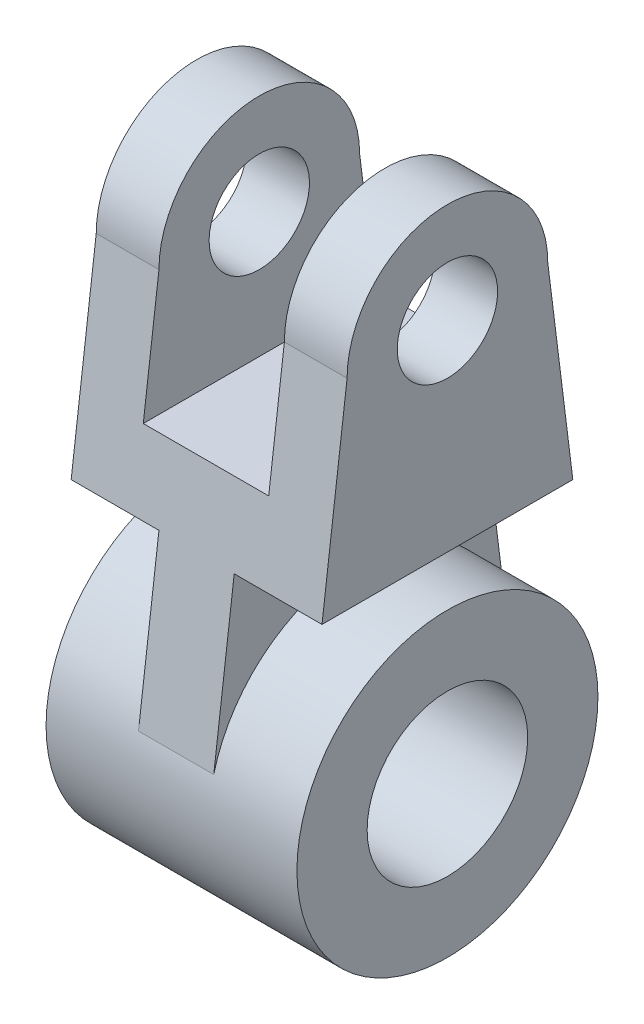
ISO-10303-21;
HEADER;
FILE_DESCRIPTION(('STEP AP214'),'2;1');
FILE_NAME('part.step','',(''),(''),'','','');
FILE_SCHEMA(('AUTOMOTIVE_DESIGN { 1 0 10303 214 1 1 1 1 }'));
ENDSEC;
DATA;
#1=APPLICATION_CONTEXT('core data for automotive mechanical design processes');
#2=APPLICATION_PROTOCOL_DEFINITION('international standard','automotive_design',2000,#1);
#3=PRODUCT_CONTEXT('',#1,'mechanical');
#4=PRODUCT('Part','Part','',(#3));
#5=PRODUCT_RELATED_PRODUCT_CATEGORY('part','',(#4));
#6=PRODUCT_DEFINITION_FORMATION('','',#4);
#7=PRODUCT_DEFINITION_CONTEXT('part definition',#1,'design');
#8=PRODUCT_DEFINITION('design','',#6,#7);
#9=PRODUCT_DEFINITION_SHAPE('','',#8);
#10=(LENGTH_UNIT() NAMED_UNIT(*) SI_UNIT(.MILLI.,.METRE.));
#11=(NAMED_UNIT(*) PLANE_ANGLE_UNIT() SI_UNIT($,.RADIAN.));
#12=(NAMED_UNIT(*) SI_UNIT($,.STERADIAN.) SOLID_ANGLE_UNIT());
#13=UNCERTAINTY_MEASURE_WITH_UNIT(LENGTH_MEASURE(1.E-05),#10,'distance_accuracy_value','');
#14=(GEOMETRIC_REPRESENTATION_CONTEXT(3) GLOBAL_UNCERTAINTY_ASSIGNED_CONTEXT((#13)) GLOBAL_UNIT_ASSIGNED_CONTEXT((#10,
#11,#12)) REPRESENTATION_CONTEXT('',''));
#15=CARTESIAN_POINT('',(0.,0.,0.));
#16=DIRECTION('',(0.,0.,1.));
#17=DIRECTION('',(1.,0.,0.));
#18=AXIS2_PLACEMENT_3D('',#15,#16,#17);
#19=CARTESIAN_POINT('',(25.,80.,0.));
#20=DIRECTION('',(-1.,0.,0.));
#21=DIRECTION('',(0.,0.,1.));
#22=AXIS2_PLACEMENT_3D('',#19,#20,#21);
#23=CYLINDRICAL_SURFACE('',#22,20.);
#24=DIRECTION('',(-1.,0.,0.));
#25=VECTOR('',#24,1.);
#26=CARTESIAN_POINT('',(25.,80.,-20.));
#27=LINE('',#26,#25);
#28=CARTESIAN_POINT('',(25.,80.,-20.));
#29=VERTEX_POINT('',#28);
#30=CARTESIAN_POINT('',(12.5,80.,-20.));
#31=VERTEX_POINT('',#30);
#32=EDGE_CURVE('E217',#29,#31,#27,.T.);
#33=ORIENTED_EDGE('',*,*,#32,.T.);
#34=CARTESIAN_POINT('',(12.5,80.,0.));
#35=DIRECTION('',(1.,0.,0.));
#36=DIRECTION('',(0.,1.,0.));
#37=AXIS2_PLACEMENT_3D('',#34,#35,#36);
#38=CIRCLE('',#37,20.);
#39=CARTESIAN_POINT('',(12.5,80.,20.));
#40=VERTEX_POINT('',#39);
#41=EDGE_CURVE('E169',#31,#40,#38,.T.);
#42=ORIENTED_EDGE('',*,*,#41,.T.);
#43=DIRECTION('',(-1.,0.,0.));
#44=VECTOR('',#43,1.);
#45=CARTESIAN_POINT('',(25.,80.,20.));
#46=LINE('',#45,#44);
#47=CARTESIAN_POINT('',(25.,80.,20.));
#48=VERTEX_POINT('',#47);
#49=EDGE_CURVE('E234',#48,#40,#46,.T.);
#50=ORIENTED_EDGE('',*,*,#49,.F.);
#51=CARTESIAN_POINT('',(25.,80.,0.));
#52=DIRECTION('',(1.,0.,0.));
#53=DIRECTION('',(0.,0.,-1.));
#54=AXIS2_PLACEMENT_3D('',#51,#52,#53);
#55=CIRCLE('',#54,20.);
#56=EDGE_CURVE('E190',#29,#48,#55,.T.);
#57=ORIENTED_EDGE('',*,*,#56,.F.);
#58=EDGE_LOOP('',(#33,#42,#50,#57));
#59=FACE_BOUND('',#58,.T.);
#60=ADVANCED_FACE('F49',(#59),#23,.T.);
#61=CARTESIAN_POINT('',(25.,80.,0.));
#62=DIRECTION('',(-1.,0.,0.));
#63=DIRECTION('',(0.,0.,1.));
#64=AXIS2_PLACEMENT_3D('',#61,#62,#63);
#65=CYLINDRICAL_SURFACE('',#64,10.);
#66=CARTESIAN_POINT('',(12.5,80.,0.));
#67=DIRECTION('',(1.,0.,0.));
#68=DIRECTION('',(0.,1.,0.));
#69=AXIS2_PLACEMENT_3D('',#66,#67,#68);
#70=CIRCLE('',#69,10.);
#71=CARTESIAN_POINT('',(12.5,90.,0.));
#72=VERTEX_POINT('',#71);
#73=EDGE_CURVE('E164',#72,#72,#70,.T.);
#74=ORIENTED_EDGE('',*,*,#73,.F.);
#75=EDGE_LOOP('',(#74));
#76=FACE_BOUND('',#75,.T.);
#77=CARTESIAN_POINT('',(25.,80.,0.));
#78=DIRECTION('',(1.,0.,0.));
#79=DIRECTION('',(0.,0.,-1.));
#80=AXIS2_PLACEMENT_3D('',#77,#78,#79);
#81=CIRCLE('',#80,10.);
#82=CARTESIAN_POINT('',(25.,80.,-10.));
#83=VERTEX_POINT('',#82);
#84=EDGE_CURVE('E182',#83,#83,#81,.T.);
#85=ORIENTED_EDGE('',*,*,#84,.T.);
#86=EDGE_LOOP('',(#85));
#87=FACE_BOUND('',#86,.T.);
#88=ADVANCED_FACE('F355',(#76,#87),#65,.F.);
#89=CARTESIAN_POINT('',(25.,0.,0.));
#90=DIRECTION('',(1.,0.,0.));
#91=DIRECTION('',(0.,0.,-1.));
#92=AXIS2_PLACEMENT_3D('',#89,#90,#91);
#93=PLANE('',#92);
#94=CARTESIAN_POINT('',(25.,0.,0.));
#95=DIRECTION('',(1.,0.,0.));
#96=DIRECTION('',(0.,0.,-1.));
#97=AXIS2_PLACEMENT_3D('',#94,#95,#96);
#98=CIRCLE('',#97,30.);
#99=CARTESIAN_POINT('',(25.,0.,-30.));
#100=VERTEX_POINT('',#99);
#101=EDGE_CURVE('E296',#100,#100,#98,.T.);
#102=ORIENTED_EDGE('',*,*,#101,.T.);
#103=EDGE_LOOP('',(#102));
#104=FACE_BOUND('',#103,.T.);
#105=CARTESIAN_POINT('',(25.,0.,0.));
#106=DIRECTION('',(1.,0.,0.));
#107=DIRECTION('',(0.,0.,-1.));
#108=AXIS2_PLACEMENT_3D('',#105,#106,#107);
#109=CIRCLE('',#108,16.);
#110=CARTESIAN_POINT('',(25.,0.,-16.));
#111=VERTEX_POINT('',#110);
#112=EDGE_CURVE('E288',#111,#111,#109,.T.);
#113=ORIENTED_EDGE('',*,*,#112,.F.);
#114=EDGE_LOOP('',(#113));
#115=FACE_BOUND('',#114,.T.);
#116=ADVANCED_FACE('F360',(#104,#115),#93,.T.);
#117=CARTESIAN_POINT('',(-25.,0.,0.));
#118=DIRECTION('',(1.,0.,0.));
#119=DIRECTION('',(0.,0.,-1.));
#120=AXIS2_PLACEMENT_3D('',#117,#118,#119);
#121=PLANE('',#120);
#122=CARTESIAN_POINT('',(-25.,0.,0.));
#123=DIRECTION('',(1.,0.,0.));
#124=DIRECTION('',(0.,0.,-1.));
#125=AXIS2_PLACEMENT_3D('',#122,#123,#124);
#126=CIRCLE('',#125,30.);
#127=CARTESIAN_POINT('',(-25.,0.,-30.));
#128=VERTEX_POINT('',#127);
#129=EDGE_CURVE('E292',#128,#128,#126,.T.);
#130=ORIENTED_EDGE('',*,*,#129,.F.);
#131=EDGE_LOOP('',(#130));
#132=FACE_BOUND('',#131,.T.);
#133=CARTESIAN_POINT('',(-25.,0.,0.));
#134=DIRECTION('',(1.,0.,0.));
#135=DIRECTION('',(0.,0.,-1.));
#136=AXIS2_PLACEMENT_3D('',#133,#134,#135);
#137=CIRCLE('',#136,16.);
#138=CARTESIAN_POINT('',(-25.,0.,-16.));
#139=VERTEX_POINT('',#138);
#140=EDGE_CURVE('E287',#139,#139,#137,.T.);
#141=ORIENTED_EDGE('',*,*,#140,.T.);
#142=EDGE_LOOP('',(#141));
#143=FACE_BOUND('',#142,.T.);
#144=ADVANCED_FACE('F395',(#132,#143),#121,.F.);
#145=CARTESIAN_POINT('',(25.,0.,0.));
#146=DIRECTION('',(-1.,0.,0.));
#147=DIRECTION('',(0.,0.,1.));
#148=AXIS2_PLACEMENT_3D('',#145,#146,#147);
#149=CYLINDRICAL_SURFACE('',#148,30.);
#150=DIRECTION('',(-1.,0.,0.));
#151=VECTOR('',#150,1.);
#152=CARTESIAN_POINT('',(25.,7.38461538461518,-29.0769230769231));
#153=LINE('',#152,#151);
#154=CARTESIAN_POINT('',(-7.5,7.38461538461545,-29.0769230769231));
#155=VERTEX_POINT('',#154);
#156=CARTESIAN_POINT('',(7.5,7.38461538461517,-29.0769230769231));
#157=VERTEX_POINT('',#156);
#158=EDGE_CURVE('E58',#155,#157,#153,.F.);
#159=ORIENTED_EDGE('',*,*,#158,.T.);
#160=CARTESIAN_POINT('',(7.5,0.,0.));
#161=DIRECTION('',(1.,0.,0.));
#162=DIRECTION('',(0.,0.,-1.));
#163=AXIS2_PLACEMENT_3D('',#160,#161,#162);
#164=CIRCLE('',#163,30.);
#165=CARTESIAN_POINT('',(7.5,7.38461538461517,29.0769230769231));
#166=VERTEX_POINT('',#165);
#167=EDGE_CURVE('E283',#157,#166,#164,.T.);
#168=ORIENTED_EDGE('',*,*,#167,.T.);
#169=DIRECTION('',(-1.,0.,0.));
#170=VECTOR('',#169,1.);
#171=CARTESIAN_POINT('',(25.,7.38461538461518,29.0769230769231));
#172=LINE('',#171,#170);
#173=CARTESIAN_POINT('',(-7.5,7.38461538461545,29.0769230769231));
#174=VERTEX_POINT('',#173);
#175=EDGE_CURVE('E300',#166,#174,#172,.T.);
#176=ORIENTED_EDGE('',*,*,#175,.T.);
#177=CARTESIAN_POINT('',(-7.5,0.,0.));
#178=DIRECTION('',(-1.,0.,0.));
#179=DIRECTION('',(0.,0.,1.));
#180=AXIS2_PLACEMENT_3D('',#177,#178,#179);
#181=CIRCLE('',#180,30.);
#182=EDGE_CURVE('E259',#174,#155,#181,.T.);
#183=ORIENTED_EDGE('',*,*,#182,.T.);
#184=EDGE_LOOP('',(#159,#168,#176,#183));
#185=FACE_BOUND('',#184,.T.);
#186=ORIENTED_EDGE('',*,*,#101,.F.);
#187=EDGE_LOOP('',(#186));
#188=FACE_BOUND('',#187,.T.);
#189=ORIENTED_EDGE('',*,*,#129,.T.);
#190=EDGE_LOOP('',(#189));
#191=FACE_BOUND('',#190,.T.);
#192=ADVANCED_FACE('F51',(#185,#188,#191),#149,.T.);
#193=CARTESIAN_POINT('',(25.,0.,0.));
#194=DIRECTION('',(-1.,0.,0.));
#195=DIRECTION('',(0.,0.,1.));
#196=AXIS2_PLACEMENT_3D('',#193,#194,#195);
#197=CYLINDRICAL_SURFACE('',#196,16.);
#198=ORIENTED_EDGE('',*,*,#112,.T.);
#199=EDGE_LOOP('',(#198));
#200=FACE_BOUND('',#199,.T.);
#201=ORIENTED_EDGE('',*,*,#140,.F.);
#202=EDGE_LOOP('',(#201));
#203=FACE_BOUND('',#202,.T.);
#204=ADVANCED_FACE('F390',(#200,#203),#197,.F.);
#205=CARTESIAN_POINT('',(0.,3.69230769230769,-29.5384615384616));
#206=DIRECTION('',(0.,0.124034734589208,-0.992277876713668));
#207=DIRECTION('',(0.,0.992277876713668,0.124034734589208));
#208=AXIS2_PLACEMENT_3D('',#205,#206,#207);
#209=PLANE('',#208);
#210=DIRECTION('',(0.,-0.992277876713668,-0.124034734589208));
#211=VECTOR('',#210,1.);
#212=CARTESIAN_POINT('',(12.5,3.69230769230769,-29.5384615384616));
#213=LINE('',#212,#211);
#214=CARTESIAN_POINT('',(12.5,55.,-23.125));
#215=VERTEX_POINT('',#214);
#216=EDGE_CURVE('E151',#31,#215,#213,.T.);
#217=ORIENTED_EDGE('',*,*,#216,.F.);
#218=ORIENTED_EDGE('',*,*,#32,.F.);
#219=DIRECTION('',(0.,0.992277876713668,0.124034734589208));
#220=VECTOR('',#219,1.);
#221=CARTESIAN_POINT('',(25.,40.,-25.));
#222=LINE('',#221,#220);
#223=CARTESIAN_POINT('',(25.,40.,-25.));
#224=VERTEX_POINT('',#223);
#225=EDGE_CURVE('E201',#224,#29,#222,.T.);
#226=ORIENTED_EDGE('',*,*,#225,.F.);
#227=DIRECTION('',(-1.,0.,0.));
#228=VECTOR('',#227,1.);
#229=CARTESIAN_POINT('',(25.,40.,-25.));
#230=LINE('',#229,#228);
#231=CARTESIAN_POINT('',(7.5,40.,-25.));
#232=VERTEX_POINT('',#231);
#233=EDGE_CURVE('E230',#224,#232,#230,.T.);
#234=ORIENTED_EDGE('',*,*,#233,.T.);
#235=DIRECTION('',(0.,-0.992277876713668,-0.124034734589208));
#236=VECTOR('',#235,1.);
#237=CARTESIAN_POINT('',(7.5,40.,-25.));
#238=LINE('',#237,#236);
#239=EDGE_CURVE('E263',#232,#157,#238,.T.);
#240=ORIENTED_EDGE('',*,*,#239,.T.);
#241=ORIENTED_EDGE('',*,*,#158,.F.);
#242=DIRECTION('',(0.,-0.992277876713668,-0.124034734589208));
#243=VECTOR('',#242,1.);
#244=CARTESIAN_POINT('',(-7.5,40.,-25.));
#245=LINE('',#244,#243);
#246=CARTESIAN_POINT('',(-7.5,40.,-25.));
#247=VERTEX_POINT('',#246);
#248=EDGE_CURVE('E73',#247,#155,#245,.T.);
#249=ORIENTED_EDGE('',*,*,#248,.F.);
#250=CARTESIAN_POINT('',(-25.,40.,-25.));
#251=VERTEX_POINT('',#250);
#252=EDGE_CURVE('E221',#247,#251,#230,.T.);
#253=ORIENTED_EDGE('',*,*,#252,.T.);
#254=DIRECTION('',(0.,0.992277876713668,0.124034734589208));
#255=VECTOR('',#254,1.);
#256=CARTESIAN_POINT('',(-25.,40.,-25.));
#257=LINE('',#256,#255);
#258=CARTESIAN_POINT('',(-25.,80.,-20.));
#259=VERTEX_POINT('',#258);
#260=EDGE_CURVE('E195',#251,#259,#257,.T.);
#261=ORIENTED_EDGE('',*,*,#260,.T.);
#262=CARTESIAN_POINT('',(-12.5,80.,-20.));
#263=VERTEX_POINT('',#262);
#264=EDGE_CURVE('E162',#263,#259,#27,.T.);
#265=ORIENTED_EDGE('',*,*,#264,.F.);
#266=DIRECTION('',(0.,0.992277876713668,0.124034734589208));
#267=VECTOR('',#266,1.);
#268=CARTESIAN_POINT('',(-12.5,3.69230769230769,-29.5384615384616));
#269=LINE('',#268,#267);
#270=CARTESIAN_POINT('',(-12.5,55.,-23.125));
#271=VERTEX_POINT('',#270);
#272=EDGE_CURVE('E65',#271,#263,#269,.T.);
#273=ORIENTED_EDGE('',*,*,#272,.F.);
#274=DIRECTION('',(-1.,0.,0.));
#275=VECTOR('',#274,1.);
#276=CARTESIAN_POINT('',(0.,55.,-23.125));
#277=LINE('',#276,#275);
#278=EDGE_CURVE('E141',#215,#271,#277,.T.);
#279=ORIENTED_EDGE('',*,*,#278,.F.);
#280=EDGE_LOOP('',(#217,#218,#226,#234,#240,#241,#249,#253,#261,#265,#273,#279));
#281=FACE_BOUND('',#280,.T.);
#282=ADVANCED_FACE('F160',(#281),#209,.T.);
#283=CARTESIAN_POINT('',(0.,3.69230769230769,29.5384615384616));
#284=DIRECTION('',(0.,0.124034734589208,0.992277876713668));
#285=DIRECTION('',(0.,-0.992277876713668,0.124034734589208));
#286=AXIS2_PLACEMENT_3D('',#283,#284,#285);
#287=PLANE('',#286);
#288=DIRECTION('',(0.,0.992277876713668,-0.124034734589208));
#289=VECTOR('',#288,1.);
#290=CARTESIAN_POINT('',(12.5,3.69230769230769,29.5384615384616));
#291=LINE('',#290,#289);
#292=CARTESIAN_POINT('',(12.5,55.,23.125));
#293=VERTEX_POINT('',#292);
#294=EDGE_CURVE('E177',#293,#40,#291,.T.);
#295=ORIENTED_EDGE('',*,*,#294,.F.);
#296=DIRECTION('',(1.,0.,0.));
#297=VECTOR('',#296,1.);
#298=CARTESIAN_POINT('',(0.,55.,23.125));
#299=LINE('',#298,#297);
#300=CARTESIAN_POINT('',(-12.5,55.,23.125));
#301=VERTEX_POINT('',#300);
#302=EDGE_CURVE('E12',#301,#293,#299,.T.);
#303=ORIENTED_EDGE('',*,*,#302,.F.);
#304=DIRECTION('',(0.,-0.992277876713668,0.124034734589208));
#305=VECTOR('',#304,1.);
#306=CARTESIAN_POINT('',(-12.5,3.69230769230769,29.5384615384616));
#307=LINE('',#306,#305);
#308=CARTESIAN_POINT('',(-12.5,80.,20.));
#309=VERTEX_POINT('',#308);
#310=EDGE_CURVE('E156',#309,#301,#307,.T.);
#311=ORIENTED_EDGE('',*,*,#310,.F.);
#312=CARTESIAN_POINT('',(-25.,80.,20.));
#313=VERTEX_POINT('',#312);
#314=EDGE_CURVE('E238',#309,#313,#46,.T.);
#315=ORIENTED_EDGE('',*,*,#314,.T.);
#316=DIRECTION('',(0.,-0.992277876713668,0.124034734589208));
#317=VECTOR('',#316,1.);
#318=CARTESIAN_POINT('',(-25.,80.,20.));
#319=LINE('',#318,#317);
#320=CARTESIAN_POINT('',(-25.,40.,25.));
#321=VERTEX_POINT('',#320);
#322=EDGE_CURVE('E207',#313,#321,#319,.T.);
#323=ORIENTED_EDGE('',*,*,#322,.T.);
#324=DIRECTION('',(-1.,0.,0.));
#325=VECTOR('',#324,1.);
#326=CARTESIAN_POINT('',(25.,40.,25.));
#327=LINE('',#326,#325);
#328=CARTESIAN_POINT('',(-7.5,40.,25.));
#329=VERTEX_POINT('',#328);
#330=EDGE_CURVE('E233',#329,#321,#327,.T.);
#331=ORIENTED_EDGE('',*,*,#330,.F.);
#332=DIRECTION('',(0.,-0.992277876713668,0.124034734589208));
#333=VECTOR('',#332,1.);
#334=CARTESIAN_POINT('',(-7.5,40.,25.));
#335=LINE('',#334,#333);
#336=EDGE_CURVE('E260',#329,#174,#335,.T.);
#337=ORIENTED_EDGE('',*,*,#336,.T.);
#338=ORIENTED_EDGE('',*,*,#175,.F.);
#339=DIRECTION('',(0.,-0.992277876713668,0.124034734589208));
#340=VECTOR('',#339,1.);
#341=CARTESIAN_POINT('',(7.5,40.,25.));
#342=LINE('',#341,#340);
#343=CARTESIAN_POINT('',(7.5,40.,25.));
#344=VERTEX_POINT('',#343);
#345=EDGE_CURVE('E267',#344,#166,#342,.T.);
#346=ORIENTED_EDGE('',*,*,#345,.F.);
#347=CARTESIAN_POINT('',(25.,40.,25.));
#348=VERTEX_POINT('',#347);
#349=EDGE_CURVE('E247',#348,#344,#327,.T.);
#350=ORIENTED_EDGE('',*,*,#349,.F.);
#351=DIRECTION('',(0.,-0.992277876713668,0.124034734589208));
#352=VECTOR('',#351,1.);
#353=CARTESIAN_POINT('',(25.,80.,20.));
#354=LINE('',#353,#352);
#355=EDGE_CURVE('E194',#48,#348,#354,.T.);
#356=ORIENTED_EDGE('',*,*,#355,.F.);
#357=ORIENTED_EDGE('',*,*,#49,.T.);
#358=EDGE_LOOP('',(#295,#303,#311,#315,#323,#331,#337,#338,#346,#350,#356,#357));
#359=FACE_BOUND('',#358,.T.);
#360=ADVANCED_FACE('F326',(#359),#287,.T.);
#361=CARTESIAN_POINT('',(7.5,0.,0.));
#362=DIRECTION('',(1.,0.,0.));
#363=DIRECTION('',(0.,0.,-1.));
#364=AXIS2_PLACEMENT_3D('',#361,#362,#363);
#365=PLANE('',#364);
#366=ORIENTED_EDGE('',*,*,#167,.F.);
#367=ORIENTED_EDGE('',*,*,#239,.F.);
#368=DIRECTION('',(0.,0.,1.));
#369=VECTOR('',#368,1.);
#370=CARTESIAN_POINT('',(7.5,40.,-25.));
#371=LINE('',#370,#369);
#372=EDGE_CURVE('E237',#232,#344,#371,.T.);
#373=ORIENTED_EDGE('',*,*,#372,.T.);
#374=ORIENTED_EDGE('',*,*,#345,.T.);
#375=EDGE_LOOP('',(#366,#367,#373,#374));
#376=FACE_BOUND('',#375,.T.);
#377=ADVANCED_FACE('F343',(#376),#365,.T.);
#378=CARTESIAN_POINT('',(-7.5,0.,0.));
#379=DIRECTION('',(-1.,0.,0.));
#380=DIRECTION('',(0.,0.,1.));
#381=AXIS2_PLACEMENT_3D('',#378,#379,#380);
#382=PLANE('',#381);
#383=ORIENTED_EDGE('',*,*,#182,.F.);
#384=ORIENTED_EDGE('',*,*,#336,.F.);
#385=DIRECTION('',(0.,0.,-1.));
#386=VECTOR('',#385,1.);
#387=CARTESIAN_POINT('',(-7.5,40.,-25.));
#388=LINE('',#387,#386);
#389=EDGE_CURVE('E245',#329,#247,#388,.T.);
#390=ORIENTED_EDGE('',*,*,#389,.T.);
#391=ORIENTED_EDGE('',*,*,#248,.T.);
#392=EDGE_LOOP('',(#383,#384,#390,#391));
#393=FACE_BOUND('',#392,.T.);
#394=ADVANCED_FACE('F338',(#393),#382,.T.);
#395=CARTESIAN_POINT('',(25.,40.,25.));
#396=DIRECTION('',(0.,1.,0.));
#397=DIRECTION('',(0.,0.,1.));
#398=AXIS2_PLACEMENT_3D('',#395,#396,#397);
#399=PLANE('',#398);
#400=ORIENTED_EDGE('',*,*,#349,.T.);
#401=ORIENTED_EDGE('',*,*,#372,.F.);
#402=ORIENTED_EDGE('',*,*,#233,.F.);
#403=DIRECTION('',(0.,0.,-1.));
#404=VECTOR('',#403,1.);
#405=CARTESIAN_POINT('',(25.,40.,25.));
#406=LINE('',#405,#404);
#407=EDGE_CURVE('E198',#348,#224,#406,.T.);
#408=ORIENTED_EDGE('',*,*,#407,.F.);
#409=EDGE_LOOP('',(#400,#401,#402,#408));
#410=FACE_BOUND('',#409,.T.);
#411=ADVANCED_FACE('F346',(#410),#399,.F.);
#412=ORIENTED_EDGE('',*,*,#252,.F.);
#413=ORIENTED_EDGE('',*,*,#389,.F.);
#414=ORIENTED_EDGE('',*,*,#330,.T.);
#415=DIRECTION('',(0.,0.,-1.));
#416=VECTOR('',#415,1.);
#417=CARTESIAN_POINT('',(-25.,40.,25.));
#418=LINE('',#417,#416);
#419=EDGE_CURVE('E211',#321,#251,#418,.T.);
#420=ORIENTED_EDGE('',*,*,#419,.T.);
#421=EDGE_LOOP('',(#412,#413,#414,#420));
#422=FACE_BOUND('',#421,.T.);
#423=ADVANCED_FACE('F376',(#422),#399,.F.);
#424=CARTESIAN_POINT('',(25.,80.,0.));
#425=DIRECTION('',(1.,0.,0.));
#426=DIRECTION('',(0.,0.,-1.));
#427=AXIS2_PLACEMENT_3D('',#424,#425,#426);
#428=PLANE('',#427);
#429=ORIENTED_EDGE('',*,*,#56,.T.);
#430=ORIENTED_EDGE('',*,*,#355,.T.);
#431=ORIENTED_EDGE('',*,*,#407,.T.);
#432=ORIENTED_EDGE('',*,*,#225,.T.);
#433=EDGE_LOOP('',(#429,#430,#431,#432));
#434=FACE_BOUND('',#433,.T.);
#435=ORIENTED_EDGE('',*,*,#84,.F.);
#436=EDGE_LOOP('',(#435));
#437=FACE_BOUND('',#436,.T.);
#438=ADVANCED_FACE('F351',(#434,#437),#428,.T.);
#439=CARTESIAN_POINT('',(-25.,80.,0.));
#440=DIRECTION('',(1.,0.,0.));
#441=DIRECTION('',(0.,0.,-1.));
#442=AXIS2_PLACEMENT_3D('',#439,#440,#441);
#443=PLANE('',#442);
#444=CARTESIAN_POINT('',(-25.,80.,0.));
#445=DIRECTION('',(1.,0.,0.));
#446=DIRECTION('',(0.,0.,-1.));
#447=AXIS2_PLACEMENT_3D('',#444,#445,#446);
#448=CIRCLE('',#447,20.);
#449=EDGE_CURVE('E186',#259,#313,#448,.T.);
#450=ORIENTED_EDGE('',*,*,#449,.F.);
#451=ORIENTED_EDGE('',*,*,#260,.F.);
#452=ORIENTED_EDGE('',*,*,#419,.F.);
#453=ORIENTED_EDGE('',*,*,#322,.F.);
#454=EDGE_LOOP('',(#450,#451,#452,#453));
#455=FACE_BOUND('',#454,.T.);
#456=CARTESIAN_POINT('',(-25.,80.,0.));
#457=DIRECTION('',(1.,0.,0.));
#458=DIRECTION('',(0.,0.,-1.));
#459=AXIS2_PLACEMENT_3D('',#456,#457,#458);
#460=CIRCLE('',#459,10.);
#461=CARTESIAN_POINT('',(-25.,80.,-10.));
#462=VERTEX_POINT('',#461);
#463=EDGE_CURVE('E150',#462,#462,#460,.T.);
#464=ORIENTED_EDGE('',*,*,#463,.T.);
#465=EDGE_LOOP('',(#464));
#466=FACE_BOUND('',#465,.T.);
#467=ADVANCED_FACE('F332',(#455,#466),#443,.F.);
#468=ORIENTED_EDGE('',*,*,#314,.F.);
#469=CARTESIAN_POINT('',(-12.5,80.,0.));
#470=DIRECTION('',(-1.,0.,0.));
#471=DIRECTION('',(0.,-1.,0.));
#472=AXIS2_PLACEMENT_3D('',#469,#470,#471);
#473=CIRCLE('',#472,20.);
#474=EDGE_CURVE('E170',#309,#263,#473,.T.);
#475=ORIENTED_EDGE('',*,*,#474,.T.);
#476=ORIENTED_EDGE('',*,*,#264,.T.);
#477=ORIENTED_EDGE('',*,*,#449,.T.);
#478=EDGE_LOOP('',(#468,#475,#476,#477));
#479=FACE_BOUND('',#478,.T.);
#480=ADVANCED_FACE('F328',(#479),#23,.T.);
#481=CARTESIAN_POINT('',(-12.5,80.,0.));
#482=DIRECTION('',(-1.,0.,0.));
#483=DIRECTION('',(0.,-1.,0.));
#484=AXIS2_PLACEMENT_3D('',#481,#482,#483);
#485=CIRCLE('',#484,10.);
#486=CARTESIAN_POINT('',(-12.5,70.,0.));
#487=VERTEX_POINT('',#486);
#488=EDGE_CURVE('E316',#487,#487,#485,.T.);
#489=ORIENTED_EDGE('',*,*,#488,.F.);
#490=EDGE_LOOP('',(#489));
#491=FACE_BOUND('',#490,.T.);
#492=ORIENTED_EDGE('',*,*,#463,.F.);
#493=EDGE_LOOP('',(#492));
#494=FACE_BOUND('',#493,.T.);
#495=ADVANCED_FACE('F363',(#491,#494),#65,.F.);
#496=CARTESIAN_POINT('',(12.5,105.,-54.5));
#497=DIRECTION('',(1.,0.,0.));
#498=DIRECTION('',(0.,1.,0.));
#499=AXIS2_PLACEMENT_3D('',#496,#497,#498);
#500=PLANE('',#499);
#501=ORIENTED_EDGE('',*,*,#216,.T.);
#502=DIRECTION('',(0.,0.,1.));
#503=VECTOR('',#502,1.);
#504=CARTESIAN_POINT('',(12.5,55.,-54.5));
#505=LINE('',#504,#503);
#506=EDGE_CURVE('E146',#215,#293,#505,.T.);
#507=ORIENTED_EDGE('',*,*,#506,.T.);
#508=ORIENTED_EDGE('',*,*,#294,.T.);
#509=ORIENTED_EDGE('',*,*,#41,.F.);
#510=EDGE_LOOP('',(#501,#507,#508,#509));
#511=FACE_BOUND('',#510,.T.);
#512=ORIENTED_EDGE('',*,*,#73,.T.);
#513=EDGE_LOOP('',(#512));
#514=FACE_BOUND('',#513,.T.);
#515=ADVANCED_FACE('F324',(#511,#514),#500,.F.);
#516=CARTESIAN_POINT('',(-12.5,55.,-54.5));
#517=DIRECTION('',(0.,-1.,0.));
#518=DIRECTION('',(0.,0.,-1.));
#519=AXIS2_PLACEMENT_3D('',#516,#517,#518);
#520=PLANE('',#519);
#521=ORIENTED_EDGE('',*,*,#278,.T.);
#522=DIRECTION('',(0.,0.,1.));
#523=VECTOR('',#522,1.);
#524=CARTESIAN_POINT('',(-12.5,55.,-54.5));
#525=LINE('',#524,#523);
#526=EDGE_CURVE('E143',#271,#301,#525,.T.);
#527=ORIENTED_EDGE('',*,*,#526,.T.);
#528=ORIENTED_EDGE('',*,*,#302,.T.);
#529=ORIENTED_EDGE('',*,*,#506,.F.);
#530=EDGE_LOOP('',(#521,#527,#528,#529));
#531=FACE_BOUND('',#530,.T.);
#532=ADVANCED_FACE('F142',(#531),#520,.F.);
#533=CARTESIAN_POINT('',(-12.5,105.,-54.5));
#534=DIRECTION('',(-1.,0.,0.));
#535=DIRECTION('',(0.,-1.,0.));
#536=AXIS2_PLACEMENT_3D('',#533,#534,#535);
#537=PLANE('',#536);
#538=ORIENTED_EDGE('',*,*,#272,.T.);
#539=ORIENTED_EDGE('',*,*,#474,.F.);
#540=ORIENTED_EDGE('',*,*,#310,.T.);
#541=ORIENTED_EDGE('',*,*,#526,.F.);
#542=EDGE_LOOP('',(#538,#539,#540,#541));
#543=FACE_BOUND('',#542,.T.);
#544=ORIENTED_EDGE('',*,*,#488,.T.);
#545=EDGE_LOOP('',(#544));
#546=FACE_BOUND('',#545,.T.);
#547=ADVANCED_FACE('F153',(#543,#546),#537,.F.);
#548=CLOSED_SHELL('',(#60,#88,#116,#144,#192,#204,#282,#360,#377,#394,#411,#423,#438,#467,#480,
#495,#515,#532,#547));
#549=MANIFOLD_SOLID_BREP('B2',#548);
#550=ADVANCED_BREP_SHAPE_REPRESENTATION('',(#18,#549),#14);
#551=SHAPE_DEFINITION_REPRESENTATION(#9,#550);
ENDSEC;
END-ISO-10303-21;
